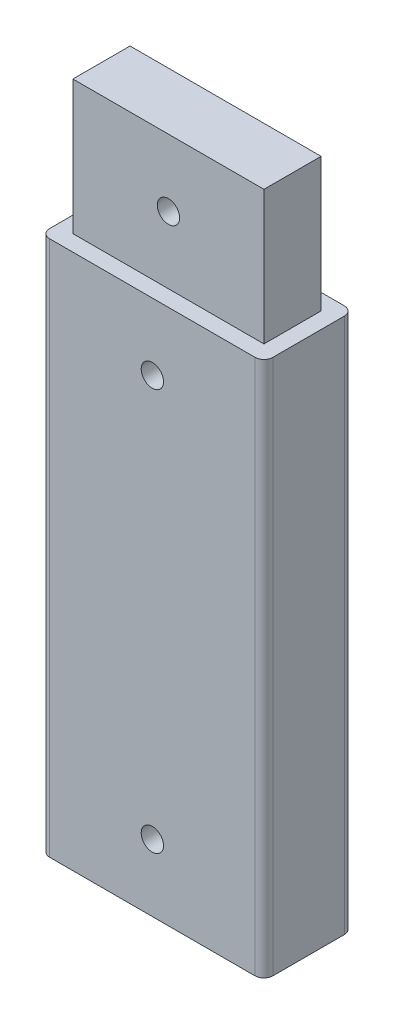
ISO-10303-21;
HEADER;
FILE_DESCRIPTION(('STEP AP214'),'2;1');
FILE_NAME('part.step','',(''),(''),'','','');
FILE_SCHEMA(('AUTOMOTIVE_DESIGN { 1 0 10303 214 1 1 1 1 }'));
ENDSEC;
DATA;
#1=APPLICATION_CONTEXT('core data for automotive mechanical design processes');
#2=APPLICATION_PROTOCOL_DEFINITION('international standard','automotive_design',2000,#1);
#3=PRODUCT_CONTEXT('',#1,'mechanical');
#4=PRODUCT('Part','Part','',(#3));
#5=PRODUCT_RELATED_PRODUCT_CATEGORY('part','',(#4));
#6=PRODUCT_DEFINITION_FORMATION('','',#4);
#7=PRODUCT_DEFINITION_CONTEXT('part definition',#1,'design');
#8=PRODUCT_DEFINITION('design','',#6,#7);
#9=PRODUCT_DEFINITION_SHAPE('','',#8);
#10=(LENGTH_UNIT() NAMED_UNIT(*) SI_UNIT(.MILLI.,.METRE.));
#11=(NAMED_UNIT(*) PLANE_ANGLE_UNIT() SI_UNIT($,.RADIAN.));
#12=(NAMED_UNIT(*) SI_UNIT($,.STERADIAN.) SOLID_ANGLE_UNIT());
#13=UNCERTAINTY_MEASURE_WITH_UNIT(LENGTH_MEASURE(1.E-05),#10,'distance_accuracy_value','');
#14=(GEOMETRIC_REPRESENTATION_CONTEXT(3) GLOBAL_UNCERTAINTY_ASSIGNED_CONTEXT((#13)) GLOBAL_UNIT_ASSIGNED_CONTEXT((#10,
#11,#12)) REPRESENTATION_CONTEXT('',''));
#15=CARTESIAN_POINT('',(0.,0.,0.));
#16=DIRECTION('',(0.,0.,1.));
#17=DIRECTION('',(1.,0.,0.));
#18=AXIS2_PLACEMENT_3D('',#15,#16,#17);
#19=CARTESIAN_POINT('',(2.,120.,-2.));
#20=DIRECTION('',(0.,-1.,0.));
#21=DIRECTION('',(0.,0.,-1.));
#22=AXIS2_PLACEMENT_3D('',#19,#20,#21);
#23=PLANE('',#22);
#24=CARTESIAN_POINT('',(2.,120.,-2.));
#25=DIRECTION('',(0.,1.,0.));
#26=DIRECTION('',(0.,0.,-1.));
#27=AXIS2_PLACEMENT_3D('',#24,#25,#26);
#28=CIRCLE('',#27,2.);
#29=CARTESIAN_POINT('',(0.,120.,-2.));
#30=VERTEX_POINT('',#29);
#31=CARTESIAN_POINT('',(2.,120.,0.));
#32=VERTEX_POINT('',#31);
#33=EDGE_CURVE('E250',#30,#32,#28,.T.);
#34=ORIENTED_EDGE('',*,*,#33,.T.);
#35=DIRECTION('',(1.,0.,0.));
#36=VECTOR('',#35,1.);
#37=CARTESIAN_POINT('',(2.,120.,0.));
#38=LINE('',#37,#36);
#39=CARTESIAN_POINT('',(48.,120.,0.));
#40=VERTEX_POINT('',#39);
#41=EDGE_CURVE('E254',#32,#40,#38,.T.);
#42=ORIENTED_EDGE('',*,*,#41,.T.);
#43=CARTESIAN_POINT('',(48.,120.,-2.));
#44=DIRECTION('',(0.,1.,0.));
#45=DIRECTION('',(0.,0.,1.));
#46=AXIS2_PLACEMENT_3D('',#43,#44,#45);
#47=CIRCLE('',#46,2.);
#48=CARTESIAN_POINT('',(50.,120.,-2.));
#49=VERTEX_POINT('',#48);
#50=EDGE_CURVE('E258',#40,#49,#47,.T.);
#51=ORIENTED_EDGE('',*,*,#50,.T.);
#52=DIRECTION('',(0.,0.,-1.));
#53=VECTOR('',#52,1.);
#54=CARTESIAN_POINT('',(50.,120.,-2.));
#55=LINE('',#54,#53);
#56=CARTESIAN_POINT('',(50.,120.,-18.));
#57=VERTEX_POINT('',#56);
#58=EDGE_CURVE('E261',#49,#57,#55,.T.);
#59=ORIENTED_EDGE('',*,*,#58,.T.);
#60=CARTESIAN_POINT('',(48.,120.,-18.));
#61=DIRECTION('',(0.,1.,0.));
#62=DIRECTION('',(0.,0.,-1.));
#63=AXIS2_PLACEMENT_3D('',#60,#61,#62);
#64=CIRCLE('',#63,2.);
#65=CARTESIAN_POINT('',(48.,120.,-20.));
#66=VERTEX_POINT('',#65);
#67=EDGE_CURVE('E264',#57,#66,#64,.T.);
#68=ORIENTED_EDGE('',*,*,#67,.T.);
#69=DIRECTION('',(-1.,0.,0.));
#70=VECTOR('',#69,1.);
#71=CARTESIAN_POINT('',(2.,120.,-20.));
#72=LINE('',#71,#70);
#73=CARTESIAN_POINT('',(2.,120.,-20.));
#74=VERTEX_POINT('',#73);
#75=EDGE_CURVE('E267',#66,#74,#72,.T.);
#76=ORIENTED_EDGE('',*,*,#75,.T.);
#77=CARTESIAN_POINT('',(2.,120.,-18.));
#78=DIRECTION('',(0.,1.,0.));
#79=DIRECTION('',(0.,0.,-1.));
#80=AXIS2_PLACEMENT_3D('',#77,#78,#79);
#81=CIRCLE('',#80,2.);
#82=CARTESIAN_POINT('',(0.,120.,-18.));
#83=VERTEX_POINT('',#82);
#84=EDGE_CURVE('E270',#74,#83,#81,.T.);
#85=ORIENTED_EDGE('',*,*,#84,.T.);
#86=DIRECTION('',(0.,0.,1.));
#87=VECTOR('',#86,1.);
#88=CARTESIAN_POINT('',(0.,120.,-2.));
#89=LINE('',#88,#87);
#90=EDGE_CURVE('E273',#83,#30,#89,.T.);
#91=ORIENTED_EDGE('',*,*,#90,.T.);
#92=EDGE_LOOP('',(#34,#42,#51,#59,#68,#76,#85,#91));
#93=FACE_BOUND('',#92,.T.);
#94=DIRECTION('',(-1.,0.,0.));
#95=VECTOR('',#94,1.);
#96=CARTESIAN_POINT('',(46.4,120.,-16.4));
#97=LINE('',#96,#95);
#98=CARTESIAN_POINT('',(46.4,120.,-16.4));
#99=VERTEX_POINT('',#98);
#100=CARTESIAN_POINT('',(3.6,120.,-16.4));
#101=VERTEX_POINT('',#100);
#102=EDGE_CURVE('E61',#99,#101,#97,.T.);
#103=ORIENTED_EDGE('',*,*,#102,.F.);
#104=DIRECTION('',(0.,0.,-1.));
#105=VECTOR('',#104,1.);
#106=CARTESIAN_POINT('',(46.4,120.,-3.6));
#107=LINE('',#106,#105);
#108=CARTESIAN_POINT('',(46.4,120.,-3.6));
#109=VERTEX_POINT('',#108);
#110=EDGE_CURVE('E65',#109,#99,#107,.T.);
#111=ORIENTED_EDGE('',*,*,#110,.F.);
#112=DIRECTION('',(1.,0.,0.));
#113=VECTOR('',#112,1.);
#114=CARTESIAN_POINT('',(3.6,120.,-3.6));
#115=LINE('',#114,#113);
#116=CARTESIAN_POINT('',(3.6,120.,-3.6));
#117=VERTEX_POINT('',#116);
#118=EDGE_CURVE('E659',#117,#109,#115,.T.);
#119=ORIENTED_EDGE('',*,*,#118,.F.);
#120=DIRECTION('',(0.,0.,1.));
#121=VECTOR('',#120,1.);
#122=CARTESIAN_POINT('',(3.6,120.,-16.4));
#123=LINE('',#122,#121);
#124=EDGE_CURVE('E648',#101,#117,#123,.T.);
#125=ORIENTED_EDGE('',*,*,#124,.F.);
#126=EDGE_LOOP('',(#103,#111,#119,#125));
#127=FACE_BOUND('',#126,.T.);
#128=ADVANCED_FACE('F43',(#93,#127),#23,.F.);
#129=CARTESIAN_POINT('',(2.,120.,-2.));
#130=DIRECTION('',(0.,-1.,0.));
#131=DIRECTION('',(0.,0.,-1.));
#132=AXIS2_PLACEMENT_3D('',#129,#130,#131);
#133=CYLINDRICAL_SURFACE('',#132,2.);
#134=CARTESIAN_POINT('',(2.,0.,-2.));
#135=DIRECTION('',(0.,1.,0.));
#136=DIRECTION('',(0.,0.,-1.));
#137=AXIS2_PLACEMENT_3D('',#134,#135,#136);
#138=CIRCLE('',#137,2.);
#139=CARTESIAN_POINT('',(0.,0.,-2.));
#140=VERTEX_POINT('',#139);
#141=CARTESIAN_POINT('',(2.,0.,0.));
#142=VERTEX_POINT('',#141);
#143=EDGE_CURVE('E240',#140,#142,#138,.T.);
#144=ORIENTED_EDGE('',*,*,#143,.T.);
#145=DIRECTION('',(0.,-1.,0.));
#146=VECTOR('',#145,1.);
#147=CARTESIAN_POINT('',(2.,120.,0.));
#148=LINE('',#147,#146);
#149=EDGE_CURVE('E11',#32,#142,#148,.T.);
#150=ORIENTED_EDGE('',*,*,#149,.F.);
#151=ORIENTED_EDGE('',*,*,#33,.F.);
#152=DIRECTION('',(0.,-1.,0.));
#153=VECTOR('',#152,1.);
#154=CARTESIAN_POINT('',(0.,120.,-2.));
#155=LINE('',#154,#153);
#156=EDGE_CURVE('E276',#30,#140,#155,.T.);
#157=ORIENTED_EDGE('',*,*,#156,.T.);
#158=EDGE_LOOP('',(#144,#150,#151,#157));
#159=FACE_BOUND('',#158,.T.);
#160=ADVANCED_FACE('F45',(#159),#133,.T.);
#161=CARTESIAN_POINT('',(2.,120.,0.));
#162=DIRECTION('',(0.,0.,-1.));
#163=DIRECTION('',(-1.,0.,0.));
#164=AXIS2_PLACEMENT_3D('',#161,#162,#163);
#165=PLANE('',#164);
#166=CARTESIAN_POINT('',(25.,105.,0.));
#167=DIRECTION('',(0.,0.,1.));
#168=DIRECTION('',(1.,0.,0.));
#169=AXIS2_PLACEMENT_3D('',#166,#167,#168);
#170=CIRCLE('',#169,2.5);
#171=CARTESIAN_POINT('',(27.5,105.,0.));
#172=VERTEX_POINT('',#171);
#173=EDGE_CURVE('E187',#172,#172,#170,.T.);
#174=ORIENTED_EDGE('',*,*,#173,.F.);
#175=EDGE_LOOP('',(#174));
#176=FACE_BOUND('',#175,.T.);
#177=CARTESIAN_POINT('',(25.,15.,0.));
#178=DIRECTION('',(0.,0.,1.));
#179=DIRECTION('',(1.,0.,0.));
#180=AXIS2_PLACEMENT_3D('',#177,#178,#179);
#181=CIRCLE('',#180,2.5);
#182=CARTESIAN_POINT('',(27.5,15.,0.));
#183=VERTEX_POINT('',#182);
#184=EDGE_CURVE('E182',#183,#183,#181,.T.);
#185=ORIENTED_EDGE('',*,*,#184,.F.);
#186=EDGE_LOOP('',(#185));
#187=FACE_BOUND('',#186,.T.);
#188=DIRECTION('',(1.,0.,0.));
#189=VECTOR('',#188,1.);
#190=CARTESIAN_POINT('',(2.,0.,0.));
#191=LINE('',#190,#189);
#192=CARTESIAN_POINT('',(48.,0.,0.));
#193=VERTEX_POINT('',#192);
#194=EDGE_CURVE('E280',#142,#193,#191,.T.);
#195=ORIENTED_EDGE('',*,*,#194,.T.);
#196=DIRECTION('',(0.,-1.,0.));
#197=VECTOR('',#196,1.);
#198=CARTESIAN_POINT('',(48.,120.,0.));
#199=LINE('',#198,#197);
#200=EDGE_CURVE('E53',#40,#193,#199,.T.);
#201=ORIENTED_EDGE('',*,*,#200,.F.);
#202=ORIENTED_EDGE('',*,*,#41,.F.);
#203=ORIENTED_EDGE('',*,*,#149,.T.);
#204=EDGE_LOOP('',(#195,#201,#202,#203));
#205=FACE_BOUND('',#204,.T.);
#206=ADVANCED_FACE('F382',(#176,#187,#205),#165,.F.);
#207=CARTESIAN_POINT('',(48.,120.,-2.));
#208=DIRECTION('',(0.,-1.,0.));
#209=DIRECTION('',(0.,0.,-1.));
#210=AXIS2_PLACEMENT_3D('',#207,#208,#209);
#211=CYLINDRICAL_SURFACE('',#210,2.);
#212=CARTESIAN_POINT('',(48.,0.,-2.));
#213=DIRECTION('',(0.,1.,0.));
#214=DIRECTION('',(0.,0.,1.));
#215=AXIS2_PLACEMENT_3D('',#212,#213,#214);
#216=CIRCLE('',#215,2.);
#217=CARTESIAN_POINT('',(50.,0.,-2.));
#218=VERTEX_POINT('',#217);
#219=EDGE_CURVE('E283',#193,#218,#216,.T.);
#220=ORIENTED_EDGE('',*,*,#219,.T.);
#221=DIRECTION('',(0.,-1.,0.));
#222=VECTOR('',#221,1.);
#223=CARTESIAN_POINT('',(50.,120.,-2.));
#224=LINE('',#223,#222);
#225=EDGE_CURVE('E319',#49,#218,#224,.T.);
#226=ORIENTED_EDGE('',*,*,#225,.F.);
#227=ORIENTED_EDGE('',*,*,#50,.F.);
#228=ORIENTED_EDGE('',*,*,#200,.T.);
#229=EDGE_LOOP('',(#220,#226,#227,#228));
#230=FACE_BOUND('',#229,.T.);
#231=ADVANCED_FACE('F380',(#230),#211,.T.);
#232=CARTESIAN_POINT('',(50.,120.,-2.));
#233=DIRECTION('',(-1.,0.,0.));
#234=DIRECTION('',(0.,0.,1.));
#235=AXIS2_PLACEMENT_3D('',#232,#233,#234);
#236=PLANE('',#235);
#237=DIRECTION('',(0.,0.,-1.));
#238=VECTOR('',#237,1.);
#239=CARTESIAN_POINT('',(50.,0.,-2.));
#240=LINE('',#239,#238);
#241=CARTESIAN_POINT('',(50.,0.,-18.));
#242=VERTEX_POINT('',#241);
#243=EDGE_CURVE('E286',#218,#242,#240,.T.);
#244=ORIENTED_EDGE('',*,*,#243,.T.);
#245=DIRECTION('',(0.,-1.,0.));
#246=VECTOR('',#245,1.);
#247=CARTESIAN_POINT('',(50.,120.,-18.));
#248=LINE('',#247,#246);
#249=EDGE_CURVE('E315',#57,#242,#248,.T.);
#250=ORIENTED_EDGE('',*,*,#249,.F.);
#251=ORIENTED_EDGE('',*,*,#58,.F.);
#252=ORIENTED_EDGE('',*,*,#225,.T.);
#253=EDGE_LOOP('',(#244,#250,#251,#252));
#254=FACE_BOUND('',#253,.T.);
#255=ADVANCED_FACE('F376',(#254),#236,.F.);
#256=CARTESIAN_POINT('',(48.,120.,-18.));
#257=DIRECTION('',(0.,-1.,0.));
#258=DIRECTION('',(0.,0.,-1.));
#259=AXIS2_PLACEMENT_3D('',#256,#257,#258);
#260=CYLINDRICAL_SURFACE('',#259,2.);
#261=CARTESIAN_POINT('',(48.,0.,-18.));
#262=DIRECTION('',(0.,1.,0.));
#263=DIRECTION('',(0.,0.,-1.));
#264=AXIS2_PLACEMENT_3D('',#261,#262,#263);
#265=CIRCLE('',#264,2.);
#266=CARTESIAN_POINT('',(48.,0.,-20.));
#267=VERTEX_POINT('',#266);
#268=EDGE_CURVE('E289',#242,#267,#265,.T.);
#269=ORIENTED_EDGE('',*,*,#268,.T.);
#270=DIRECTION('',(0.,-1.,0.));
#271=VECTOR('',#270,1.);
#272=CARTESIAN_POINT('',(48.,120.,-20.));
#273=LINE('',#272,#271);
#274=EDGE_CURVE('E311',#66,#267,#273,.T.);
#275=ORIENTED_EDGE('',*,*,#274,.F.);
#276=ORIENTED_EDGE('',*,*,#67,.F.);
#277=ORIENTED_EDGE('',*,*,#249,.T.);
#278=EDGE_LOOP('',(#269,#275,#276,#277));
#279=FACE_BOUND('',#278,.T.);
#280=ADVANCED_FACE('F344',(#279),#260,.T.);
#281=CARTESIAN_POINT('',(2.,120.,-20.));
#282=DIRECTION('',(0.,0.,1.));
#283=DIRECTION('',(1.,0.,0.));
#284=AXIS2_PLACEMENT_3D('',#281,#282,#283);
#285=PLANE('',#284);
#286=CARTESIAN_POINT('',(25.,105.,-20.));
#287=DIRECTION('',(0.,0.,1.));
#288=DIRECTION('',(1.,0.,0.));
#289=AXIS2_PLACEMENT_3D('',#286,#287,#288);
#290=CIRCLE('',#289,2.5);
#291=CARTESIAN_POINT('',(27.5,105.,-20.));
#292=VERTEX_POINT('',#291);
#293=EDGE_CURVE('E47',#292,#292,#290,.T.);
#294=ORIENTED_EDGE('',*,*,#293,.T.);
#295=EDGE_LOOP('',(#294));
#296=FACE_BOUND('',#295,.T.);
#297=CARTESIAN_POINT('',(25.,15.,-20.));
#298=DIRECTION('',(0.,0.,1.));
#299=DIRECTION('',(1.,0.,0.));
#300=AXIS2_PLACEMENT_3D('',#297,#298,#299);
#301=CIRCLE('',#300,2.5);
#302=CARTESIAN_POINT('',(27.5,15.,-20.));
#303=VERTEX_POINT('',#302);
#304=EDGE_CURVE('E201',#303,#303,#301,.T.);
#305=ORIENTED_EDGE('',*,*,#304,.T.);
#306=EDGE_LOOP('',(#305));
#307=FACE_BOUND('',#306,.T.);
#308=DIRECTION('',(-1.,0.,0.));
#309=VECTOR('',#308,1.);
#310=CARTESIAN_POINT('',(2.,0.,-20.));
#311=LINE('',#310,#309);
#312=CARTESIAN_POINT('',(2.,0.,-20.));
#313=VERTEX_POINT('',#312);
#314=EDGE_CURVE('E292',#267,#313,#311,.T.);
#315=ORIENTED_EDGE('',*,*,#314,.T.);
#316=DIRECTION('',(0.,-1.,0.));
#317=VECTOR('',#316,1.);
#318=CARTESIAN_POINT('',(2.,120.,-20.));
#319=LINE('',#318,#317);
#320=EDGE_CURVE('E307',#74,#313,#319,.T.);
#321=ORIENTED_EDGE('',*,*,#320,.F.);
#322=ORIENTED_EDGE('',*,*,#75,.F.);
#323=ORIENTED_EDGE('',*,*,#274,.T.);
#324=EDGE_LOOP('',(#315,#321,#322,#323));
#325=FACE_BOUND('',#324,.T.);
#326=ADVANCED_FACE('F340',(#296,#307,#325),#285,.F.);
#327=CARTESIAN_POINT('',(2.,120.,-18.));
#328=DIRECTION('',(0.,-1.,0.));
#329=DIRECTION('',(0.,0.,-1.));
#330=AXIS2_PLACEMENT_3D('',#327,#328,#329);
#331=CYLINDRICAL_SURFACE('',#330,2.);
#332=CARTESIAN_POINT('',(2.,0.,-18.));
#333=DIRECTION('',(0.,1.,0.));
#334=DIRECTION('',(0.,0.,-1.));
#335=AXIS2_PLACEMENT_3D('',#332,#333,#334);
#336=CIRCLE('',#335,2.);
#337=CARTESIAN_POINT('',(0.,0.,-18.));
#338=VERTEX_POINT('',#337);
#339=EDGE_CURVE('E295',#313,#338,#336,.T.);
#340=ORIENTED_EDGE('',*,*,#339,.T.);
#341=DIRECTION('',(0.,-1.,0.));
#342=VECTOR('',#341,1.);
#343=CARTESIAN_POINT('',(0.,120.,-18.));
#344=LINE('',#343,#342);
#345=EDGE_CURVE('E303',#83,#338,#344,.T.);
#346=ORIENTED_EDGE('',*,*,#345,.F.);
#347=ORIENTED_EDGE('',*,*,#84,.F.);
#348=ORIENTED_EDGE('',*,*,#320,.T.);
#349=EDGE_LOOP('',(#340,#346,#347,#348));
#350=FACE_BOUND('',#349,.T.);
#351=ADVANCED_FACE('F343',(#350),#331,.T.);
#352=CARTESIAN_POINT('',(0.,120.,-2.));
#353=DIRECTION('',(1.,0.,0.));
#354=DIRECTION('',(0.,0.,-1.));
#355=AXIS2_PLACEMENT_3D('',#352,#353,#354);
#356=PLANE('',#355);
#357=DIRECTION('',(0.,0.,1.));
#358=VECTOR('',#357,1.);
#359=CARTESIAN_POINT('',(0.,0.,-2.));
#360=LINE('',#359,#358);
#361=EDGE_CURVE('E255',#338,#140,#360,.T.);
#362=ORIENTED_EDGE('',*,*,#361,.T.);
#363=ORIENTED_EDGE('',*,*,#156,.F.);
#364=ORIENTED_EDGE('',*,*,#90,.F.);
#365=ORIENTED_EDGE('',*,*,#345,.T.);
#366=EDGE_LOOP('',(#362,#363,#364,#365));
#367=FACE_BOUND('',#366,.T.);
#368=ADVANCED_FACE('F362',(#367),#356,.F.);
#369=CARTESIAN_POINT('',(2.,0.,-2.));
#370=DIRECTION('',(0.,-1.,0.));
#371=DIRECTION('',(0.,0.,-1.));
#372=AXIS2_PLACEMENT_3D('',#369,#370,#371);
#373=PLANE('',#372);
#374=DIRECTION('',(-1.,0.,0.));
#375=VECTOR('',#374,1.);
#376=CARTESIAN_POINT('',(46.,0.,-4.));
#377=LINE('',#376,#375);
#378=CARTESIAN_POINT('',(46.,0.,-4.));
#379=VERTEX_POINT('',#378);
#380=CARTESIAN_POINT('',(4.,0.,-4.));
#381=VERTEX_POINT('',#380);
#382=EDGE_CURVE('E223',#379,#381,#377,.T.);
#383=ORIENTED_EDGE('',*,*,#382,.F.);
#384=DIRECTION('',(0.,0.,1.));
#385=VECTOR('',#384,1.);
#386=CARTESIAN_POINT('',(46.,0.,-16.));
#387=LINE('',#386,#385);
#388=CARTESIAN_POINT('',(46.,0.,-16.));
#389=VERTEX_POINT('',#388);
#390=EDGE_CURVE('E210',#389,#379,#387,.T.);
#391=ORIENTED_EDGE('',*,*,#390,.F.);
#392=DIRECTION('',(1.,0.,0.));
#393=VECTOR('',#392,1.);
#394=CARTESIAN_POINT('',(4.,0.,-16.));
#395=LINE('',#394,#393);
#396=CARTESIAN_POINT('',(4.,0.,-16.));
#397=VERTEX_POINT('',#396);
#398=EDGE_CURVE('E230',#397,#389,#395,.T.);
#399=ORIENTED_EDGE('',*,*,#398,.F.);
#400=DIRECTION('',(0.,0.,-1.));
#401=VECTOR('',#400,1.);
#402=CARTESIAN_POINT('',(4.,0.,-4.));
#403=LINE('',#402,#401);
#404=EDGE_CURVE('E226',#381,#397,#403,.T.);
#405=ORIENTED_EDGE('',*,*,#404,.F.);
#406=EDGE_LOOP('',(#383,#391,#399,#405));
#407=FACE_BOUND('',#406,.T.);
#408=ORIENTED_EDGE('',*,*,#143,.F.);
#409=ORIENTED_EDGE('',*,*,#361,.F.);
#410=ORIENTED_EDGE('',*,*,#339,.F.);
#411=ORIENTED_EDGE('',*,*,#314,.F.);
#412=ORIENTED_EDGE('',*,*,#268,.F.);
#413=ORIENTED_EDGE('',*,*,#243,.F.);
#414=ORIENTED_EDGE('',*,*,#219,.F.);
#415=ORIENTED_EDGE('',*,*,#194,.F.);
#416=EDGE_LOOP('',(#408,#409,#410,#411,#412,#413,#414,#415));
#417=FACE_BOUND('',#416,.T.);
#418=ADVANCED_FACE('F359',(#407,#417),#373,.T.);
#419=CARTESIAN_POINT('',(46.,30.,-4.));
#420=DIRECTION('',(0.,0.,1.));
#421=DIRECTION('',(1.,0.,0.));
#422=AXIS2_PLACEMENT_3D('',#419,#420,#421);
#423=PLANE('',#422);
#424=CARTESIAN_POINT('',(25.,15.,-4.));
#425=DIRECTION('',(0.,0.,1.));
#426=DIRECTION('',(1.,0.,0.));
#427=AXIS2_PLACEMENT_3D('',#424,#425,#426);
#428=CIRCLE('',#427,2.5);
#429=CARTESIAN_POINT('',(27.5,15.,-4.));
#430=VERTEX_POINT('',#429);
#431=EDGE_CURVE('E197',#430,#430,#428,.T.);
#432=ORIENTED_EDGE('',*,*,#431,.T.);
#433=EDGE_LOOP('',(#432));
#434=FACE_BOUND('',#433,.T.);
#435=ORIENTED_EDGE('',*,*,#382,.T.);
#436=DIRECTION('',(0.,-1.,0.));
#437=VECTOR('',#436,1.);
#438=CARTESIAN_POINT('',(4.,30.,-4.));
#439=LINE('',#438,#437);
#440=CARTESIAN_POINT('',(4.,30.,-4.));
#441=VERTEX_POINT('',#440);
#442=EDGE_CURVE('E222',#441,#381,#439,.T.);
#443=ORIENTED_EDGE('',*,*,#442,.F.);
#444=DIRECTION('',(-1.,0.,0.));
#445=VECTOR('',#444,1.);
#446=CARTESIAN_POINT('',(46.,30.,-4.));
#447=LINE('',#446,#445);
#448=CARTESIAN_POINT('',(46.,30.,-4.));
#449=VERTEX_POINT('',#448);
#450=EDGE_CURVE('E205',#449,#441,#447,.T.);
#451=ORIENTED_EDGE('',*,*,#450,.F.);
#452=DIRECTION('',(0.,-1.,0.));
#453=VECTOR('',#452,1.);
#454=CARTESIAN_POINT('',(46.,30.,-4.));
#455=LINE('',#454,#453);
#456=EDGE_CURVE('E237',#449,#379,#455,.T.);
#457=ORIENTED_EDGE('',*,*,#456,.T.);
#458=EDGE_LOOP('',(#435,#443,#451,#457));
#459=FACE_BOUND('',#458,.T.);
#460=ADVANCED_FACE('F400',(#434,#459),#423,.F.);
#461=CARTESIAN_POINT('',(46.,30.,-16.));
#462=DIRECTION('',(1.,0.,0.));
#463=DIRECTION('',(0.,0.,-1.));
#464=AXIS2_PLACEMENT_3D('',#461,#462,#463);
#465=PLANE('',#464);
#466=ORIENTED_EDGE('',*,*,#390,.T.);
#467=ORIENTED_EDGE('',*,*,#456,.F.);
#468=DIRECTION('',(0.,0.,1.));
#469=VECTOR('',#468,1.);
#470=CARTESIAN_POINT('',(46.,30.,-16.));
#471=LINE('',#470,#469);
#472=CARTESIAN_POINT('',(46.,30.,-16.));
#473=VERTEX_POINT('',#472);
#474=EDGE_CURVE('E218',#473,#449,#471,.T.);
#475=ORIENTED_EDGE('',*,*,#474,.F.);
#476=DIRECTION('',(0.,-1.,0.));
#477=VECTOR('',#476,1.);
#478=CARTESIAN_POINT('',(46.,30.,-16.));
#479=LINE('',#478,#477);
#480=EDGE_CURVE('E241',#473,#389,#479,.T.);
#481=ORIENTED_EDGE('',*,*,#480,.T.);
#482=EDGE_LOOP('',(#466,#467,#475,#481));
#483=FACE_BOUND('',#482,.T.);
#484=ADVANCED_FACE('F443',(#483),#465,.F.);
#485=CARTESIAN_POINT('',(4.,30.,-16.));
#486=DIRECTION('',(0.,0.,-1.));
#487=DIRECTION('',(-1.,0.,0.));
#488=AXIS2_PLACEMENT_3D('',#485,#486,#487);
#489=PLANE('',#488);
#490=CARTESIAN_POINT('',(25.,15.,-16.));
#491=DIRECTION('',(0.,0.,-1.));
#492=DIRECTION('',(-1.,0.,0.));
#493=AXIS2_PLACEMENT_3D('',#490,#491,#492);
#494=CIRCLE('',#493,2.5);
#495=CARTESIAN_POINT('',(22.5,15.,-16.));
#496=VERTEX_POINT('',#495);
#497=EDGE_CURVE('E195',#496,#496,#494,.T.);
#498=ORIENTED_EDGE('',*,*,#497,.T.);
#499=EDGE_LOOP('',(#498));
#500=FACE_BOUND('',#499,.T.);
#501=ORIENTED_EDGE('',*,*,#398,.T.);
#502=ORIENTED_EDGE('',*,*,#480,.F.);
#503=DIRECTION('',(1.,0.,0.));
#504=VECTOR('',#503,1.);
#505=CARTESIAN_POINT('',(4.,30.,-16.));
#506=LINE('',#505,#504);
#507=CARTESIAN_POINT('',(4.,30.,-16.));
#508=VERTEX_POINT('',#507);
#509=EDGE_CURVE('E214',#508,#473,#506,.T.);
#510=ORIENTED_EDGE('',*,*,#509,.F.);
#511=DIRECTION('',(0.,-1.,0.));
#512=VECTOR('',#511,1.);
#513=CARTESIAN_POINT('',(4.,30.,-16.));
#514=LINE('',#513,#512);
#515=EDGE_CURVE('E244',#508,#397,#514,.T.);
#516=ORIENTED_EDGE('',*,*,#515,.T.);
#517=EDGE_LOOP('',(#501,#502,#510,#516));
#518=FACE_BOUND('',#517,.T.);
#519=ADVANCED_FACE('F329',(#500,#518),#489,.F.);
#520=CARTESIAN_POINT('',(4.,30.,-4.));
#521=DIRECTION('',(-1.,0.,0.));
#522=DIRECTION('',(0.,0.,1.));
#523=AXIS2_PLACEMENT_3D('',#520,#521,#522);
#524=PLANE('',#523);
#525=ORIENTED_EDGE('',*,*,#404,.T.);
#526=ORIENTED_EDGE('',*,*,#515,.F.);
#527=DIRECTION('',(0.,0.,-1.));
#528=VECTOR('',#527,1.);
#529=CARTESIAN_POINT('',(4.,30.,-4.));
#530=LINE('',#529,#528);
#531=EDGE_CURVE('E209',#441,#508,#530,.T.);
#532=ORIENTED_EDGE('',*,*,#531,.F.);
#533=ORIENTED_EDGE('',*,*,#442,.T.);
#534=EDGE_LOOP('',(#525,#526,#532,#533));
#535=FACE_BOUND('',#534,.T.);
#536=ADVANCED_FACE('F457',(#535),#524,.F.);
#537=CARTESIAN_POINT('',(0.,30.,0.));
#538=DIRECTION('',(0.,-1.,0.));
#539=DIRECTION('',(0.,0.,-1.));
#540=AXIS2_PLACEMENT_3D('',#537,#538,#539);
#541=PLANE('',#540);
#542=ORIENTED_EDGE('',*,*,#450,.T.);
#543=ORIENTED_EDGE('',*,*,#531,.T.);
#544=ORIENTED_EDGE('',*,*,#509,.T.);
#545=ORIENTED_EDGE('',*,*,#474,.T.);
#546=EDGE_LOOP('',(#542,#543,#544,#545));
#547=FACE_BOUND('',#546,.T.);
#548=ADVANCED_FACE('F336',(#547),#541,.T.);
#549=CARTESIAN_POINT('',(25.,15.,-30.));
#550=DIRECTION('',(0.,0.,1.));
#551=DIRECTION('',(1.,0.,0.));
#552=AXIS2_PLACEMENT_3D('',#549,#550,#551);
#553=CYLINDRICAL_SURFACE('',#552,2.5);
#554=ORIENTED_EDGE('',*,*,#497,.F.);
#555=EDGE_LOOP('',(#554));
#556=FACE_BOUND('',#555,.T.);
#557=ORIENTED_EDGE('',*,*,#304,.F.);
#558=EDGE_LOOP('',(#557));
#559=FACE_BOUND('',#558,.T.);
#560=ADVANCED_FACE('F332',(#556,#559),#553,.F.);
#561=ORIENTED_EDGE('',*,*,#184,.T.);
#562=EDGE_LOOP('',(#561));
#563=FACE_BOUND('',#562,.T.);
#564=ORIENTED_EDGE('',*,*,#431,.F.);
#565=EDGE_LOOP('',(#564));
#566=FACE_BOUND('',#565,.T.);
#567=ADVANCED_FACE('F335',(#563,#566),#553,.F.);
#568=CARTESIAN_POINT('',(25.,105.,-30.));
#569=DIRECTION('',(0.,0.,1.));
#570=DIRECTION('',(1.,0.,0.));
#571=AXIS2_PLACEMENT_3D('',#568,#569,#570);
#572=CYLINDRICAL_SURFACE('',#571,2.5);
#573=ORIENTED_EDGE('',*,*,#173,.T.);
#574=EDGE_LOOP('',(#573));
#575=FACE_BOUND('',#574,.T.);
#576=ORIENTED_EDGE('',*,*,#293,.F.);
#577=EDGE_LOOP('',(#576));
#578=FACE_BOUND('',#577,.T.);
#579=ADVANCED_FACE('F480',(#575,#578),#572,.F.);
#580=CARTESIAN_POINT('',(46.4,150.,-16.4));
#581=DIRECTION('',(0.,0.,1.));
#582=DIRECTION('',(1.,0.,0.));
#583=AXIS2_PLACEMENT_3D('',#580,#581,#582);
#584=PLANE('',#583);
#585=CARTESIAN_POINT('',(25.,135.,-16.4));
#586=DIRECTION('',(0.,0.,1.));
#587=DIRECTION('',(1.,0.,0.));
#588=AXIS2_PLACEMENT_3D('',#585,#586,#587);
#589=CIRCLE('',#588,2.5);
#590=CARTESIAN_POINT('',(27.5,135.,-16.4));
#591=VERTEX_POINT('',#590);
#592=EDGE_CURVE('E643',#591,#591,#589,.T.);
#593=ORIENTED_EDGE('',*,*,#592,.T.);
#594=EDGE_LOOP('',(#593));
#595=FACE_BOUND('',#594,.T.);
#596=ORIENTED_EDGE('',*,*,#102,.T.);
#597=DIRECTION('',(0.,-1.,0.));
#598=VECTOR('',#597,1.);
#599=CARTESIAN_POINT('',(3.6,150.,-16.4));
#600=LINE('',#599,#598);
#601=CARTESIAN_POINT('',(3.6,150.,-16.4));
#602=VERTEX_POINT('',#601);
#603=EDGE_CURVE('E162',#602,#101,#600,.T.);
#604=ORIENTED_EDGE('',*,*,#603,.F.);
#605=DIRECTION('',(-1.,0.,0.));
#606=VECTOR('',#605,1.);
#607=CARTESIAN_POINT('',(46.4,150.,-16.4));
#608=LINE('',#607,#606);
#609=CARTESIAN_POINT('',(46.4,150.,-16.4));
#610=VERTEX_POINT('',#609);
#611=EDGE_CURVE('E169',#610,#602,#608,.T.);
#612=ORIENTED_EDGE('',*,*,#611,.F.);
#613=DIRECTION('',(0.,-1.,0.));
#614=VECTOR('',#613,1.);
#615=CARTESIAN_POINT('',(46.4,150.,-16.4));
#616=LINE('',#615,#614);
#617=EDGE_CURVE('E655',#610,#99,#616,.T.);
#618=ORIENTED_EDGE('',*,*,#617,.T.);
#619=EDGE_LOOP('',(#596,#604,#612,#618));
#620=FACE_BOUND('',#619,.T.);
#621=ADVANCED_FACE('F180',(#595,#620),#584,.F.);
#622=CARTESIAN_POINT('',(3.6,150.,-16.4));
#623=DIRECTION('',(1.,0.,0.));
#624=DIRECTION('',(0.,0.,-1.));
#625=AXIS2_PLACEMENT_3D('',#622,#623,#624);
#626=PLANE('',#625);
#627=ORIENTED_EDGE('',*,*,#124,.T.);
#628=DIRECTION('',(0.,-1.,0.));
#629=VECTOR('',#628,1.);
#630=CARTESIAN_POINT('',(3.6,150.,-3.6));
#631=LINE('',#630,#629);
#632=CARTESIAN_POINT('',(3.6,150.,-3.6));
#633=VERTEX_POINT('',#632);
#634=EDGE_CURVE('E164',#633,#117,#631,.T.);
#635=ORIENTED_EDGE('',*,*,#634,.F.);
#636=DIRECTION('',(0.,0.,1.));
#637=VECTOR('',#636,1.);
#638=CARTESIAN_POINT('',(3.6,150.,-16.4));
#639=LINE('',#638,#637);
#640=EDGE_CURVE('E157',#602,#633,#639,.T.);
#641=ORIENTED_EDGE('',*,*,#640,.F.);
#642=ORIENTED_EDGE('',*,*,#603,.T.);
#643=EDGE_LOOP('',(#627,#635,#641,#642));
#644=FACE_BOUND('',#643,.T.);
#645=ADVANCED_FACE('F160',(#644),#626,.F.);
#646=CARTESIAN_POINT('',(3.6,150.,-3.6));
#647=DIRECTION('',(0.,0.,-1.));
#648=DIRECTION('',(-1.,0.,0.));
#649=AXIS2_PLACEMENT_3D('',#646,#647,#648);
#650=PLANE('',#649);
#651=CARTESIAN_POINT('',(25.,135.,-3.6));
#652=DIRECTION('',(0.,0.,1.));
#653=DIRECTION('',(1.,0.,0.));
#654=AXIS2_PLACEMENT_3D('',#651,#652,#653);
#655=CIRCLE('',#654,2.5);
#656=CARTESIAN_POINT('',(27.5,135.,-3.6));
#657=VERTEX_POINT('',#656);
#658=EDGE_CURVE('E640',#657,#657,#655,.T.);
#659=ORIENTED_EDGE('',*,*,#658,.F.);
#660=EDGE_LOOP('',(#659));
#661=FACE_BOUND('',#660,.T.);
#662=ORIENTED_EDGE('',*,*,#118,.T.);
#663=DIRECTION('',(0.,-1.,0.));
#664=VECTOR('',#663,1.);
#665=CARTESIAN_POINT('',(46.4,150.,-3.6));
#666=LINE('',#665,#664);
#667=CARTESIAN_POINT('',(46.4,150.,-3.6));
#668=VERTEX_POINT('',#667);
#669=EDGE_CURVE('E189',#668,#109,#666,.T.);
#670=ORIENTED_EDGE('',*,*,#669,.F.);
#671=DIRECTION('',(1.,0.,0.));
#672=VECTOR('',#671,1.);
#673=CARTESIAN_POINT('',(3.6,150.,-3.6));
#674=LINE('',#673,#672);
#675=EDGE_CURVE('E168',#633,#668,#674,.T.);
#676=ORIENTED_EDGE('',*,*,#675,.F.);
#677=ORIENTED_EDGE('',*,*,#634,.T.);
#678=EDGE_LOOP('',(#662,#670,#676,#677));
#679=FACE_BOUND('',#678,.T.);
#680=ADVANCED_FACE('F506',(#661,#679),#650,.F.);
#681=CARTESIAN_POINT('',(46.4,150.,-3.6));
#682=DIRECTION('',(-1.,0.,0.));
#683=DIRECTION('',(0.,0.,1.));
#684=AXIS2_PLACEMENT_3D('',#681,#682,#683);
#685=PLANE('',#684);
#686=ORIENTED_EDGE('',*,*,#110,.T.);
#687=ORIENTED_EDGE('',*,*,#617,.F.);
#688=DIRECTION('',(0.,0.,-1.));
#689=VECTOR('',#688,1.);
#690=CARTESIAN_POINT('',(46.4,150.,-3.6));
#691=LINE('',#690,#689);
#692=EDGE_CURVE('E174',#668,#610,#691,.T.);
#693=ORIENTED_EDGE('',*,*,#692,.F.);
#694=ORIENTED_EDGE('',*,*,#669,.T.);
#695=EDGE_LOOP('',(#686,#687,#693,#694));
#696=FACE_BOUND('',#695,.T.);
#697=ADVANCED_FACE('F513',(#696),#685,.F.);
#698=CARTESIAN_POINT('',(0.,150.,0.));
#699=DIRECTION('',(0.,1.,0.));
#700=DIRECTION('',(0.,0.,1.));
#701=AXIS2_PLACEMENT_3D('',#698,#699,#700);
#702=PLANE('',#701);
#703=ORIENTED_EDGE('',*,*,#611,.T.);
#704=ORIENTED_EDGE('',*,*,#640,.T.);
#705=ORIENTED_EDGE('',*,*,#675,.T.);
#706=ORIENTED_EDGE('',*,*,#692,.T.);
#707=EDGE_LOOP('',(#703,#704,#705,#706));
#708=FACE_BOUND('',#707,.T.);
#709=ADVANCED_FACE('F172',(#708),#702,.T.);
#710=CARTESIAN_POINT('',(25.,135.,-33.6));
#711=DIRECTION('',(0.,0.,1.));
#712=DIRECTION('',(1.,0.,0.));
#713=AXIS2_PLACEMENT_3D('',#710,#711,#712);
#714=CYLINDRICAL_SURFACE('',#713,2.5);
#715=ORIENTED_EDGE('',*,*,#658,.T.);
#716=EDGE_LOOP('',(#715));
#717=FACE_BOUND('',#716,.T.);
#718=ORIENTED_EDGE('',*,*,#592,.F.);
#719=EDGE_LOOP('',(#718));
#720=FACE_BOUND('',#719,.T.);
#721=ADVANCED_FACE('F527',(#717,#720),#714,.F.);
#722=CLOSED_SHELL('',(#128,#160,#206,#231,#255,#280,#326,#351,#368,#418,#460,#484,#519,#536,
#548,#560,#567,#579,#621,#645,#680,#697,#709,#721));
#723=MANIFOLD_SOLID_BREP('B2',#722);
#724=ADVANCED_BREP_SHAPE_REPRESENTATION('',(#18,#723),#14);
#725=SHAPE_DEFINITION_REPRESENTATION(#9,#724);
ENDSEC;
END-ISO-10303-21;
